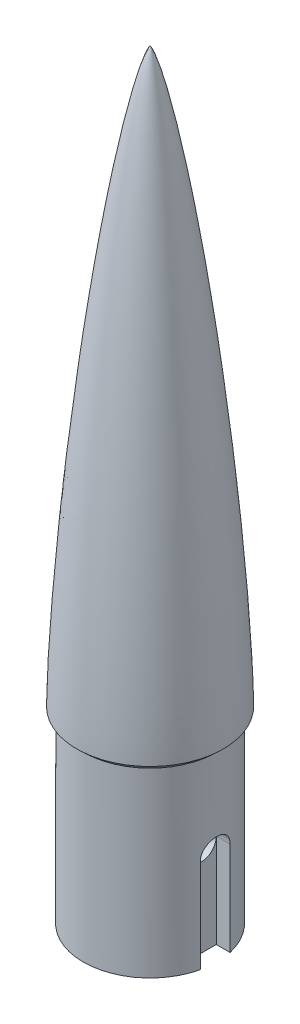
ISO-10303-21;
HEADER;
FILE_DESCRIPTION(('STEP AP214'),'2;1');
FILE_NAME('part.step','',(''),(''),'','','');
FILE_SCHEMA(('AUTOMOTIVE_DESIGN { 1 0 10303 214 1 1 1 1 }'));
ENDSEC;
DATA;
#1=APPLICATION_CONTEXT('core data for automotive mechanical design processes');
#2=APPLICATION_PROTOCOL_DEFINITION('international standard','automotive_design',2000,#1);
#3=PRODUCT_CONTEXT('',#1,'mechanical');
#4=PRODUCT('Part','Part','',(#3));
#5=PRODUCT_RELATED_PRODUCT_CATEGORY('part','',(#4));
#6=PRODUCT_DEFINITION_FORMATION('','',#4);
#7=PRODUCT_DEFINITION_CONTEXT('part definition',#1,'design');
#8=PRODUCT_DEFINITION('design','',#6,#7);
#9=PRODUCT_DEFINITION_SHAPE('','',#8);
#10=(LENGTH_UNIT() NAMED_UNIT(*) SI_UNIT(.MILLI.,.METRE.));
#11=(NAMED_UNIT(*) PLANE_ANGLE_UNIT() SI_UNIT($,.RADIAN.));
#12=(NAMED_UNIT(*) SI_UNIT($,.STERADIAN.) SOLID_ANGLE_UNIT());
#13=UNCERTAINTY_MEASURE_WITH_UNIT(LENGTH_MEASURE(1.E-05),#10,'distance_accuracy_value','');
#14=(GEOMETRIC_REPRESENTATION_CONTEXT(3) GLOBAL_UNCERTAINTY_ASSIGNED_CONTEXT((#13)) GLOBAL_UNIT_ASSIGNED_CONTEXT((#10,
#11,#12)) REPRESENTATION_CONTEXT('',''));
#15=CARTESIAN_POINT('',(0.,0.,0.));
#16=DIRECTION('',(0.,0.,1.));
#17=DIRECTION('',(1.,0.,0.));
#18=AXIS2_PLACEMENT_3D('',#15,#16,#17);
#19=CARTESIAN_POINT('',(0.,-25.,0.));
#20=DIRECTION('',(0.,1.,0.));
#21=DIRECTION('',(0.,0.,1.));
#22=AXIS2_PLACEMENT_3D('',#19,#20,#21);
#23=CYLINDRICAL_SURFACE('',#22,8.895);
#24=CARTESIAN_POINT('',(0.,-0.800000000000009,0.));
#25=DIRECTION('',(0.,-1.,0.));
#26=DIRECTION('',(0.,0.,-1.));
#27=AXIS2_PLACEMENT_3D('',#24,#25,#26);
#28=CIRCLE('',#27,8.895);
#29=CARTESIAN_POINT('',(0.,-0.800000000000009,-8.895));
#30=VERTEX_POINT('',#29);
#31=EDGE_CURVE('E11',#30,#30,#28,.T.);
#32=ORIENTED_EDGE('',*,*,#31,.T.);
#33=EDGE_LOOP('',(#32));
#34=FACE_BOUND('',#33,.T.);
#35=DIRECTION('',(0.,-1.,0.));
#36=VECTOR('',#35,1.);
#37=CARTESIAN_POINT('',(-8.67082930632215,-12.5,-1.98437499999999));
#38=LINE('',#37,#36);
#39=CARTESIAN_POINT('',(-8.67082930632215,-12.5,-1.984375));
#40=VERTEX_POINT('',#39);
#41=CARTESIAN_POINT('',(-8.67082930632215,-25.,-1.98437499999999));
#42=VERTEX_POINT('',#41);
#43=EDGE_CURVE('E187',#40,#42,#38,.T.);
#44=ORIENTED_EDGE('',*,*,#43,.F.);
#45=CARTESIAN_POINT('',(-8.895,-10.515625,0.));
#46=CARTESIAN_POINT('',(-8.89499798053136,-10.5156286782961,-0.110003108531044));
#47=CARTESIAN_POINT('',(-8.89293872905295,-10.5248028437771,-0.220050190385659));
#48=CARTESIAN_POINT('',(-8.88492294410009,-10.5612168017032,-0.437014773196951));
#49=CARTESIAN_POINT('',(-8.87896370197709,-10.5884691501126,-0.543930045069365));
#50=CARTESIAN_POINT('',(-8.86381097564101,-10.66014046251,-0.751464389222808));
#51=CARTESIAN_POINT('',(-8.85462093856362,-10.7045411348459,-0.852090038043748));
#52=CARTESIAN_POINT('',(-8.83399673910637,-10.809189812261,-1.04446068714721));
#53=CARTESIAN_POINT('',(-8.82256261666939,-10.8694375352822,-1.13620584545178));
#54=CARTESIAN_POINT('',(-8.79848845487047,-11.0051316026497,-1.30974205494041));
#55=CARTESIAN_POINT('',(-8.78583296110134,-11.0807914141361,-1.39136405863448));
#56=CARTESIAN_POINT('',(-8.76085045969245,-11.2447038420026,-1.54087074401027));
#57=CARTESIAN_POINT('',(-8.74852348238285,-11.332957616368,-1.60875416107165));
#58=CARTESIAN_POINT('',(-8.72544092397066,-11.520810939859,-1.72960902031442));
#59=CARTESIAN_POINT('',(-8.71470512331446,-11.6205296910602,-1.78239929438126));
#60=CARTESIAN_POINT('',(-8.69624278881732,-11.8277023668504,-1.87040686218199));
#61=CARTESIAN_POINT('',(-8.68851587956583,-11.9351553244818,-1.90562634832583));
#62=CARTESIAN_POINT('',(-8.67710379688232,-12.1529089981679,-1.95693151039241));
#63=CARTESIAN_POINT('',(-8.67335534128796,-12.2631356576469,-1.9733171227466));
#64=CARTESIAN_POINT('',(-8.67013460913494,-12.4848322544565,-1.98742225140913));
#65=CARTESIAN_POINT('',(-8.67066178498573,-12.5963020307519,-1.98514415802333));
#66=CARTESIAN_POINT('',(-8.6758755128654,-12.8150819521088,-1.96222763913715));
#67=CARTESIAN_POINT('',(-8.68048286491296,-12.9224308899092,-1.94193880078754));
#68=CARTESIAN_POINT('',(-8.69321246305035,-13.1321618701326,-1.88413107223078));
#69=CARTESIAN_POINT('',(-8.70133491344556,-13.2345436234669,-1.84661118050843));
#70=CARTESIAN_POINT('',(-8.72025684575896,-13.4324107413625,-1.75508849250558));
#71=CARTESIAN_POINT('',(-8.73107785800529,-13.5278322502844,-1.70095228060515));
#72=CARTESIAN_POINT('',(-8.75416459631689,-13.7083654708171,-1.57782741855743));
#73=CARTESIAN_POINT('',(-8.76643052669428,-13.7934757209513,-1.50883666682662));
#74=CARTESIAN_POINT('',(-8.79136402902234,-13.9529819654673,-1.35611581093398));
#75=CARTESIAN_POINT('',(-8.8040344247618,-14.0270934621295,-1.27208872607875));
#76=CARTESIAN_POINT('',(-8.82809796612522,-14.1602203300518,-1.09265382918496));
#77=CARTESIAN_POINT('',(-8.83949108676558,-14.2192354060537,-0.99724579460952));
#78=CARTESIAN_POINT('',(-8.85975573704167,-14.3205689320845,-0.797402322384055));
#79=CARTESIAN_POINT('',(-8.86862144653922,-14.3628489299928,-0.692946759215006));
#80=CARTESIAN_POINT('',(-8.88278925247284,-14.4291766978656,-0.478171595830713));
#81=CARTESIAN_POINT('',(-8.88809188846723,-14.4532272283998,-0.367852886206666));
#82=CARTESIAN_POINT('',(-8.89445888054048,-14.4819968395156,-0.146922244637292));
#83=CARTESIAN_POINT('',(-8.89560839126927,-14.487104381303,-0.0363632839080309));
#84=CARTESIAN_POINT('',(-8.89377875578923,-14.4788975892449,0.184028216567811));
#85=CARTESIAN_POINT('',(-8.8907999015053,-14.4655845579548,0.293860807125686));
#86=CARTESIAN_POINT('',(-8.88110209755264,-14.4212364374193,0.508386435136476));
#87=CARTESIAN_POINT('',(-8.87442639805636,-14.3904061793644,0.613123945630332));
#88=CARTESIAN_POINT('',(-8.85808259752387,-14.3121269856043,0.815940337496674));
#89=CARTESIAN_POINT('',(-8.84841423460527,-14.2646765954544,0.914018635217614));
#90=CARTESIAN_POINT('',(-8.82694819211914,-14.1537022358176,1.10233086452755));
#91=CARTESIAN_POINT('',(-8.81512120261388,-14.0899514567944,1.1924277186746));
#92=CARTESIAN_POINT('',(-8.79070766484064,-13.9484834474263,1.36078396392382));
#93=CARTESIAN_POINT('',(-8.77812101382286,-13.8707643249358,1.43904174866253));
#94=CARTESIAN_POINT('',(-8.75331093693519,-13.7017800928848,1.58304298834678));
#95=CARTESIAN_POINT('',(-8.74109914583823,-13.6102832900571,1.64851693602485));
#96=CARTESIAN_POINT('',(-8.71869698047453,-13.4173649355546,1.76317168339184));
#97=CARTESIAN_POINT('',(-8.70850651768816,-13.315943818784,1.81235319663538));
#98=CARTESIAN_POINT('',(-8.69140054463049,-13.1066041991113,1.89268852324433));
#99=CARTESIAN_POINT('',(-8.68446640876592,-12.9987267288714,1.92394509722755));
#100=CARTESIAN_POINT('',(-8.67462629679212,-12.7790753551192,1.96784118701104));
#101=CARTESIAN_POINT('',(-8.67171964652347,-12.6673021069317,1.98048381861487));
#102=CARTESIAN_POINT('',(-8.67030729710035,-12.4457524437848,1.9866564116767));
#103=CARTESIAN_POINT('',(-8.67170310734381,-12.3359883589578,1.98061409297813));
#104=CARTESIAN_POINT('',(-8.67851500496339,-12.1190849742809,1.95054750257742));
#105=CARTESIAN_POINT('',(-8.68393104095299,-12.0119456408994,1.92652346071756));
#106=CARTESIAN_POINT('',(-8.6981241844418,-11.8036893505729,1.86138575645093));
#107=CARTESIAN_POINT('',(-8.70688857054173,-11.7025512531436,1.82033672721598));
#108=CARTESIAN_POINT('',(-8.72679539432478,-11.5085347915276,1.72236893705458));
#109=CARTESIAN_POINT('',(-8.73793809113817,-11.4156573289467,1.66544844663638));
#110=CARTESIAN_POINT('',(-8.76163848646004,-11.238695474782,1.53594515186167));
#111=CARTESIAN_POINT('',(-8.77422098481682,-11.154836679788,1.46305855847869));
#112=CARTESIAN_POINT('',(-8.79921922589108,-11.0004001651611,1.30430465490752));
#113=CARTESIAN_POINT('',(-8.81163492929224,-10.9298255275292,1.21843434073407));
#114=CARTESIAN_POINT('',(-8.83510136371243,-10.8030382120514,1.03474108869537));
#115=CARTESIAN_POINT('',(-8.84613120897754,-10.7470341562857,0.936771332481138));
#116=CARTESIAN_POINT('',(-8.86537241774909,-10.6523773860926,0.732581640881906));
#117=CARTESIAN_POINT('',(-8.87358609932992,-10.6137103928671,0.626368579579056));
#118=CARTESIAN_POINT('',(-8.88483654653533,-10.5615673365609,0.43340420838887));
#119=CARTESIAN_POINT('',(-8.88862390497389,-10.5443723842688,0.347682052709739));
#120=CARTESIAN_POINT('',(-8.8937063738634,-10.5214000285145,0.174649120553264));
#121=CARTESIAN_POINT('',(-8.89500160338379,-10.5156220795683,0.0873384201749424));
#122=CARTESIAN_POINT('',(-8.895,-10.515625,0.));
#123=B_SPLINE_CURVE_WITH_KNOTS('',3,(#45,#46,#47,#48,#49,#50,#51,#52,#53,#54,#55,#56,#57,#58,
#59,#60,#61,#62,#63,#64,#65,#66,#67,#68,#69,#70,#71,#72,#73,#74,#75,#76,#77,#78,#79,#80,#81,#82,
#83,#84,#85,#86,#87,#88,#89,#90,#91,#92,#93,#94,#95,#96,#97,#98,#99,#100,#101,#102,#103,#104,
#105,#106,#107,#108,#109,#110,#111,#112,#113,#114,#115,#116,#117,#118,#119,#120,#121,#122),
.UNSPECIFIED.,.T.,.F.,(4,2,2,2,2,2,2,2,2,2,2,2,2,2,2,2,2,2,2,2,2,2,2,2,2,2,2,2,2,2,2,2,2,2,2,2,
2,2,4),(0.,0.32968958471569,0.659608391077071,0.989176249620352,1.31873824265806,
1.65322013476703,1.98773280154188,2.32610663322488,2.6644382334597,2.99730368340978,
3.33012650314447,3.65662716066737,3.98314679768962,4.31235992028412,4.64161964977686,
4.97829541698964,5.31497776845579,5.65242928429447,5.98982968812842,6.32027155964406,
6.65069006614927,6.9773221968005,7.30398291850589,7.63546294699817,7.96698791151875,
8.30488633992517,8.64276996754305,8.97869668766252,9.31456717032856,9.64280656540119,
9.97104176499135,10.2980421054524,10.6250780926347,10.9589814011184,11.2929620818613,
11.631489944489,11.9697384812382,12.2315123866697,12.493273784704),.UNSPECIFIED.);
#124=CARTESIAN_POINT('',(-8.67082930632215,-12.5,1.984375));
#125=VERTEX_POINT('',#124);
#126=EDGE_CURVE('E149',#125,#40,#123,.T.);
#127=ORIENTED_EDGE('',*,*,#126,.F.);
#128=DIRECTION('',(0.,-1.,0.));
#129=VECTOR('',#128,1.);
#130=CARTESIAN_POINT('',(-8.67082930632215,-12.5,1.984375));
#131=LINE('',#130,#129);
#132=CARTESIAN_POINT('',(-8.67082930632215,-25.,1.984375));
#133=VERTEX_POINT('',#132);
#134=EDGE_CURVE('E190',#125,#133,#131,.T.);
#135=ORIENTED_EDGE('',*,*,#134,.T.);
#136=CARTESIAN_POINT('',(0.,-25.,0.));
#137=DIRECTION('',(0.,1.,0.));
#138=DIRECTION('',(0.,0.,1.));
#139=AXIS2_PLACEMENT_3D('',#136,#137,#138);
#140=CIRCLE('',#139,8.895);
#141=CARTESIAN_POINT('',(8.67082930632215,-25.,1.984375));
#142=VERTEX_POINT('',#141);
#143=EDGE_CURVE('E196',#133,#142,#140,.T.);
#144=ORIENTED_EDGE('',*,*,#143,.T.);
#145=DIRECTION('',(0.,-1.,0.));
#146=VECTOR('',#145,1.);
#147=CARTESIAN_POINT('',(8.67082930632215,-12.5,1.984375));
#148=LINE('',#147,#146);
#149=CARTESIAN_POINT('',(8.67082930632215,-12.5,1.984375));
#150=VERTEX_POINT('',#149);
#151=EDGE_CURVE('E57',#150,#142,#148,.T.);
#152=ORIENTED_EDGE('',*,*,#151,.F.);
#153=CARTESIAN_POINT('',(8.67082930632215,-12.5,-1.984375));
#154=CARTESIAN_POINT('',(8.67083152693427,-12.3900352924012,-1.98437129476868));
#155=CARTESIAN_POINT('',(8.67294398159313,-12.2800265459929,-1.97520331559507));
#156=CARTESIAN_POINT('',(8.68114924080244,-12.0631415333078,-1.9388161542682));
#157=CARTESIAN_POINT('',(8.687244848201,-11.956267528248,-1.91158426077147));
#158=CARTESIAN_POINT('',(8.70269247518692,-11.748820633369,-1.83997273746253));
#159=CARTESIAN_POINT('',(8.71204083806803,-11.6482408168817,-1.79561235715901));
#160=CARTESIAN_POINT('',(8.73293623267991,-11.4559475998378,-1.69105869172377));
#161=CARTESIAN_POINT('',(8.74448323779282,-11.3642340919615,-1.63086559826731));
#162=CARTESIAN_POINT('',(8.76870152698746,-11.190664815864,-1.49522783567887));
#163=CARTESIAN_POINT('',(8.78138768085908,-11.1089875068265,-1.41955741552215));
#164=CARTESIAN_POINT('',(8.80632483899608,-10.959373320034,-1.25560020996667));
#165=CARTESIAN_POINT('',(8.81857580851969,-10.8914375372732,-1.16731242010812));
#166=CARTESIAN_POINT('',(8.8414245341093,-10.7705257147047,-0.979426653986215));
#167=CARTESIAN_POINT('',(8.85200269761223,-10.7177218091067,-0.879715314874414));
#168=CARTESIAN_POINT('',(8.87014575131516,-10.6296870280497,-0.672558617309702));
#169=CARTESIAN_POINT('',(8.8777109934971,-10.5944540997552,-0.56511416400382));
#170=CARTESIAN_POINT('',(8.88887072235122,-10.5431240620808,-0.347397468059264));
#171=CARTESIAN_POINT('',(8.89252784470798,-10.5267247747917,-0.237199733411299));
#172=CARTESIAN_POINT('',(8.89567645545256,-10.5125822573189,-0.0155605825450066));
#173=CARTESIAN_POINT('',(8.89516843879117,-10.5148368104668,0.0958806843305372));
#174=CARTESIAN_POINT('',(8.89009171695082,-10.5377139363359,0.31475870560092));
#175=CARTESIAN_POINT('',(8.88559503342556,-10.5580107416537,0.422231426260748));
#176=CARTESIAN_POINT('',(8.8731285194068,-10.6158765069307,0.63220575827785));
#177=CARTESIAN_POINT('',(8.86515852778899,-10.6534462681744,0.734707138772998));
#178=CARTESIAN_POINT('',(8.84652583210922,-10.7450763392216,0.932727372605715));
#179=CARTESIAN_POINT('',(8.83584323372576,-10.7992591265551,1.02818760316908));
#180=CARTESIAN_POINT('',(8.81295504188348,-10.9224856773742,1.2087789663073));
#181=CARTESIAN_POINT('',(8.80074923327929,-10.9915315411911,1.29390863638836));
#182=CARTESIAN_POINT('',(8.77584357058241,-11.1442943709138,1.45336071135604));
#183=CARTESIAN_POINT('',(8.76313874101006,-11.2282964215203,1.5274094616731));
#184=CARTESIAN_POINT('',(8.73891357366072,-11.4076579397835,1.66042127107666));
#185=CARTESIAN_POINT('',(8.72739327066983,-11.5030177408069,1.71938388720298));
#186=CARTESIAN_POINT('',(8.70682769295961,-11.7028425850512,1.82067818880462));
#187=CARTESIAN_POINT('',(8.69779041740815,-11.8073356589106,1.86295631105176));
#188=CARTESIAN_POINT('',(8.68332365321309,-12.022193123648,1.92926911648296));
#189=CARTESIAN_POINT('',(8.67789356668125,-12.1325565382453,1.95330682309304));
#190=CARTESIAN_POINT('',(8.67137842965835,-12.3535164219845,1.98202813124953));
#191=CARTESIAN_POINT('',(8.6702037566994,-12.4640584104577,1.98711100551234));
#192=CARTESIAN_POINT('',(8.67209039478514,-12.6844102825169,1.97886095731595));
#193=CARTESIAN_POINT('',(8.67515140212929,-12.7942202180243,1.96552935518464));
#194=CARTESIAN_POINT('',(8.68507970183092,-13.008588609668,1.92117571919051));
#195=CARTESIAN_POINT('',(8.69189929584423,-13.1131953191398,1.8903752346446));
#196=CARTESIAN_POINT('',(8.70853304572482,-13.3157631209793,1.81219878075513));
#197=CARTESIAN_POINT('',(8.71834749764175,-13.4137235551742,1.76482117265091));
#198=CARTESIAN_POINT('',(8.74006093984554,-13.6019411777236,1.65396154223488));
#199=CARTESIAN_POINT('',(8.75199070504297,-13.6920504352035,1.59023451518154));
#200=CARTESIAN_POINT('',(8.7765101984565,-13.8604425592094,1.4488041612309));
#201=CARTESIAN_POINT('',(8.78910001194908,-13.9387238925018,1.37109902523044));
#202=CARTESIAN_POINT('',(8.81381758079177,-14.0827966953209,1.20210799703321));
#203=CARTESIAN_POINT('',(8.82593157346983,-14.14831541272,1.11058721230565));
#204=CARTESIAN_POINT('',(8.84807556919855,-14.2630486894093,0.91760694147292));
#205=CARTESIAN_POINT('',(8.85810567158719,-14.3122640259399,0.816147929457443));
#206=CARTESIAN_POINT('',(8.87489393112164,-14.3926180815481,0.606815775294063));
#207=CARTESIAN_POINT('',(8.88167322724541,-14.423873857297,0.498989339167028));
#208=CARTESIAN_POINT('',(8.89128759699143,-14.4677855598397,0.279447263775833));
#209=CARTESIAN_POINT('',(8.89412326837703,-14.4804443055345,0.167732216568148));
#210=CARTESIAN_POINT('',(8.89551225388667,-14.4866716096712,-0.0538303410463871));
#211=CARTESIAN_POINT('',(8.89415677257247,-14.4806467378316,-0.1636660480899));
#212=CARTESIAN_POINT('',(8.88751206547856,-14.4505901194767,-0.380717396055891));
#213=CARTESIAN_POINT('',(8.88222291602629,-14.4265587223531,-0.487933087774485));
#214=CARTESIAN_POINT('',(8.86831291596493,-14.3613693329617,-0.696371660604404));
#215=CARTESIAN_POINT('',(8.85970370424092,-14.3202711322204,-0.797614067913526));
#216=CARTESIAN_POINT('',(8.84007111469181,-14.2221722616271,-0.991819184416284));
#217=CARTESIAN_POINT('',(8.82904749249992,-14.1651699819348,-1.08478105418124));
#218=CARTESIAN_POINT('',(8.80551621508588,-14.0355666300762,-1.26176241652204));
#219=CARTESIAN_POINT('',(8.79298364506869,-13.9626809241806,-1.34557017665365));
#220=CARTESIAN_POINT('',(8.76797805507896,-13.8039510336438,-1.49990415519922));
#221=CARTESIAN_POINT('',(8.7555050502752,-13.7181037126502,-1.57042714975871));
#222=CARTESIAN_POINT('',(8.73183513193552,-13.5344380779377,-1.69714603015807));
#223=CARTESIAN_POINT('',(8.72065858524308,-13.4364686619124,-1.75312694377475));
#224=CARTESIAN_POINT('',(8.7011051990314,-13.2322823615859,-1.84774053682795));
#225=CARTESIAN_POINT('',(8.69272603418347,-13.126072418212,-1.88638763425605));
#226=CARTESIAN_POINT('',(8.68123438698859,-12.9331580464439,-1.93848519859973));
#227=CARTESIAN_POINT('',(8.67735881646133,-12.847485490319,-1.95566030472962));
#228=CARTESIAN_POINT('',(8.67215546197685,-12.6745511498479,-1.97860637521381));
#229=CARTESIAN_POINT('',(8.67082754361105,-12.5872894495867,-1.98437794119458));
#230=CARTESIAN_POINT('',(8.67082930632215,-12.5,-1.984375));
#231=B_SPLINE_CURVE_WITH_KNOTS('',3,(#153,#154,#155,#156,#157,#158,#159,#160,#161,#162,#163,
#164,#165,#166,#167,#168,#169,#170,#171,#172,#173,#174,#175,#176,#177,#178,#179,#180,#181,#182,
#183,#184,#185,#186,#187,#188,#189,#190,#191,#192,#193,#194,#195,#196,#197,#198,#199,#200,#201,
#202,#203,#204,#205,#206,#207,#208,#209,#210,#211,#212,#213,#214,#215,#216,#217,#218,#219,#220,
#221,#222,#223,#224,#225,#226,#227,#228,#229,#230),.UNSPECIFIED.,.T.,.F.,(4,2,2,2,2,2,2,2,2,2,2,
2,2,2,2,2,2,2,2,2,2,2,2,2,2,2,2,2,2,2,2,2,2,2,2,2,2,2,4),(0.,0.329574133527324,
0.659380430494616,0.988817154975628,1.31824989138673,1.6528827972829,1.98754235792109,
2.32587008991828,2.66415828546683,2.99693943397993,3.32968103809655,3.65653406946799,
3.98340226493483,4.31274068542326,4.6421256759768,4.97863673959058,5.31515768273329,
5.65275035769749,5.99028706301795,6.32067223910689,6.65103372763026,6.97729620213301,
7.30359093900236,7.63509437723089,7.96664075087856,8.30464018838773,8.64262350993627,
8.97837818149084,9.31408195476448,9.64253221398148,9.97097610023751,10.2982789020109,
10.6256148460068,10.9593860612475,11.2932381697132,11.6317758832356,11.9700314818907,
12.2316596280387,12.4932739708748),.UNSPECIFIED.);
#232=CARTESIAN_POINT('',(8.67082930632215,-12.5,-1.984375));
#233=VERTEX_POINT('',#232);
#234=EDGE_CURVE('E123',#233,#150,#231,.T.);
#235=ORIENTED_EDGE('',*,*,#234,.F.);
#236=DIRECTION('',(0.,-1.,0.));
#237=VECTOR('',#236,1.);
#238=CARTESIAN_POINT('',(8.67082930632215,-12.5,-1.98437499999999));
#239=LINE('',#238,#237);
#240=CARTESIAN_POINT('',(8.67082930632215,-25.,-1.98437499999999));
#241=VERTEX_POINT('',#240);
#242=EDGE_CURVE('E161',#233,#241,#239,.T.);
#243=ORIENTED_EDGE('',*,*,#242,.T.);
#244=EDGE_CURVE('E189',#241,#42,#140,.T.);
#245=ORIENTED_EDGE('',*,*,#244,.T.);
#246=EDGE_LOOP('',(#44,#127,#135,#144,#152,#235,#243,#245));
#247=FACE_BOUND('',#246,.T.);
#248=ADVANCED_FACE('F41',(#34,#247),#23,.T.);
#249=CARTESIAN_POINT('',(0.,-25.,0.));
#250=DIRECTION('',(0.,1.,0.));
#251=DIRECTION('',(0.,0.,1.));
#252=AXIS2_PLACEMENT_3D('',#249,#250,#251);
#253=PLANE('',#252);
#254=DIRECTION('',(-1.,0.,0.));
#255=VECTOR('',#254,1.);
#256=CARTESIAN_POINT('',(6.83125,-25.,-1.984375));
#257=LINE('',#256,#255);
#258=CARTESIAN_POINT('',(6.83125,-25.,-1.984375));
#259=VERTEX_POINT('',#258);
#260=EDGE_CURVE('E154',#241,#259,#257,.T.);
#261=ORIENTED_EDGE('',*,*,#260,.T.);
#262=DIRECTION('',(0.,0.,1.));
#263=VECTOR('',#262,1.);
#264=CARTESIAN_POINT('',(6.83125,-25.,1.984375));
#265=LINE('',#264,#263);
#266=CARTESIAN_POINT('',(6.83125,-25.,1.984375));
#267=VERTEX_POINT('',#266);
#268=EDGE_CURVE('E159',#259,#267,#265,.T.);
#269=ORIENTED_EDGE('',*,*,#268,.T.);
#270=DIRECTION('',(1.,0.,0.));
#271=VECTOR('',#270,1.);
#272=CARTESIAN_POINT('',(6.83125,-25.,1.984375));
#273=LINE('',#272,#271);
#274=EDGE_CURVE('E164',#267,#142,#273,.T.);
#275=ORIENTED_EDGE('',*,*,#274,.T.);
#276=ORIENTED_EDGE('',*,*,#143,.F.);
#277=DIRECTION('',(-1.,0.,0.));
#278=VECTOR('',#277,1.);
#279=CARTESIAN_POINT('',(-6.83125,-25.,1.984375));
#280=LINE('',#279,#278);
#281=CARTESIAN_POINT('',(-6.83125,-25.,1.984375));
#282=VERTEX_POINT('',#281);
#283=EDGE_CURVE('E179',#282,#133,#280,.T.);
#284=ORIENTED_EDGE('',*,*,#283,.F.);
#285=DIRECTION('',(0.,0.,1.));
#286=VECTOR('',#285,1.);
#287=CARTESIAN_POINT('',(-6.83125,-25.,1.984375));
#288=LINE('',#287,#286);
#289=CARTESIAN_POINT('',(-6.83125,-25.,-1.984375));
#290=VERTEX_POINT('',#289);
#291=EDGE_CURVE('E183',#290,#282,#288,.T.);
#292=ORIENTED_EDGE('',*,*,#291,.F.);
#293=DIRECTION('',(1.,0.,0.));
#294=VECTOR('',#293,1.);
#295=CARTESIAN_POINT('',(-6.83125,-25.,-1.984375));
#296=LINE('',#295,#294);
#297=EDGE_CURVE('E65',#42,#290,#296,.T.);
#298=ORIENTED_EDGE('',*,*,#297,.F.);
#299=ORIENTED_EDGE('',*,*,#244,.F.);
#300=EDGE_LOOP('',(#261,#269,#275,#276,#284,#292,#298,#299));
#301=FACE_BOUND('',#300,.T.);
#302=ADVANCED_FACE('F209',(#301),#253,.F.);
#303=CARTESIAN_POINT('',(-6.83125,-12.5,-1.984375));
#304=DIRECTION('',(0.,0.,-1.));
#305=DIRECTION('',(-1.,0.,0.));
#306=AXIS2_PLACEMENT_3D('',#303,#304,#305);
#307=PLANE('',#306);
#308=ORIENTED_EDGE('',*,*,#297,.T.);
#309=DIRECTION('',(0.,-1.,0.));
#310=VECTOR('',#309,1.);
#311=CARTESIAN_POINT('',(-6.83125,-12.5,-1.984375));
#312=LINE('',#311,#310);
#313=CARTESIAN_POINT('',(-6.83125,-12.5,-1.984375));
#314=VERTEX_POINT('',#313);
#315=EDGE_CURVE('E181',#314,#290,#312,.T.);
#316=ORIENTED_EDGE('',*,*,#315,.F.);
#317=DIRECTION('',(1.,0.,0.));
#318=VECTOR('',#317,1.);
#319=CARTESIAN_POINT('',(-6.83125,-12.5,-1.984375));
#320=LINE('',#319,#318);
#321=EDGE_CURVE('E176',#40,#314,#320,.T.);
#322=ORIENTED_EDGE('',*,*,#321,.F.);
#323=ORIENTED_EDGE('',*,*,#43,.T.);
#324=EDGE_LOOP('',(#308,#316,#322,#323));
#325=FACE_BOUND('',#324,.T.);
#326=ADVANCED_FACE('F214',(#325),#307,.F.);
#327=CARTESIAN_POINT('',(-6.83125,-12.5,1.984375));
#328=DIRECTION('',(0.,0.,1.));
#329=DIRECTION('',(1.,0.,0.));
#330=AXIS2_PLACEMENT_3D('',#327,#328,#329);
#331=PLANE('',#330);
#332=ORIENTED_EDGE('',*,*,#283,.T.);
#333=ORIENTED_EDGE('',*,*,#134,.F.);
#334=DIRECTION('',(-1.,0.,0.));
#335=VECTOR('',#334,1.);
#336=CARTESIAN_POINT('',(-6.83125,-12.5,1.984375));
#337=LINE('',#336,#335);
#338=CARTESIAN_POINT('',(-6.83125,-12.5,1.984375));
#339=VERTEX_POINT('',#338);
#340=EDGE_CURVE('E178',#339,#125,#337,.T.);
#341=ORIENTED_EDGE('',*,*,#340,.F.);
#342=DIRECTION('',(0.,-1.,0.));
#343=VECTOR('',#342,1.);
#344=CARTESIAN_POINT('',(-6.83125,-12.5,1.984375));
#345=LINE('',#344,#343);
#346=EDGE_CURVE('E193',#339,#282,#345,.T.);
#347=ORIENTED_EDGE('',*,*,#346,.T.);
#348=EDGE_LOOP('',(#332,#333,#341,#347));
#349=FACE_BOUND('',#348,.T.);
#350=ADVANCED_FACE('F232',(#349),#331,.F.);
#351=CARTESIAN_POINT('',(-6.83125,-12.5,1.984375));
#352=DIRECTION('',(1.,0.,0.));
#353=DIRECTION('',(0.,0.,-1.));
#354=AXIS2_PLACEMENT_3D('',#351,#352,#353);
#355=PLANE('',#354);
#356=ORIENTED_EDGE('',*,*,#346,.F.);
#357=CARTESIAN_POINT('',(-6.83125,-12.5,0.));
#358=DIRECTION('',(1.,0.,0.));
#359=DIRECTION('',(0.,0.,-1.));
#360=AXIS2_PLACEMENT_3D('',#357,#358,#359);
#361=CIRCLE('',#360,1.984375);
#362=EDGE_CURVE('E135',#339,#314,#361,.T.);
#363=ORIENTED_EDGE('',*,*,#362,.T.);
#364=ORIENTED_EDGE('',*,*,#315,.T.);
#365=ORIENTED_EDGE('',*,*,#291,.T.);
#366=EDGE_LOOP('',(#356,#363,#364,#365));
#367=FACE_BOUND('',#366,.T.);
#368=ADVANCED_FACE('F227',(#367),#355,.F.);
#369=CARTESIAN_POINT('',(6.83125,-12.5,-1.984375));
#370=DIRECTION('',(0.,0.,1.));
#371=DIRECTION('',(1.,0.,0.));
#372=AXIS2_PLACEMENT_3D('',#369,#370,#371);
#373=PLANE('',#372);
#374=ORIENTED_EDGE('',*,*,#260,.F.);
#375=ORIENTED_EDGE('',*,*,#242,.F.);
#376=DIRECTION('',(-1.,0.,0.));
#377=VECTOR('',#376,1.);
#378=CARTESIAN_POINT('',(6.83125,-12.5,-1.984375));
#379=LINE('',#378,#377);
#380=CARTESIAN_POINT('',(6.83125,-12.5,-1.984375));
#381=VERTEX_POINT('',#380);
#382=EDGE_CURVE('E155',#233,#381,#379,.T.);
#383=ORIENTED_EDGE('',*,*,#382,.T.);
#384=DIRECTION('',(0.,-1.,0.));
#385=VECTOR('',#384,1.);
#386=CARTESIAN_POINT('',(6.83125,-12.5,-1.984375));
#387=LINE('',#386,#385);
#388=EDGE_CURVE('E168',#381,#259,#387,.T.);
#389=ORIENTED_EDGE('',*,*,#388,.T.);
#390=EDGE_LOOP('',(#374,#375,#383,#389));
#391=FACE_BOUND('',#390,.T.);
#392=ADVANCED_FACE('F240',(#391),#373,.T.);
#393=CARTESIAN_POINT('',(6.83125,-12.5,1.984375));
#394=DIRECTION('',(1.,0.,0.));
#395=DIRECTION('',(0.,0.,-1.));
#396=AXIS2_PLACEMENT_3D('',#393,#394,#395);
#397=PLANE('',#396);
#398=CARTESIAN_POINT('',(6.83125,-12.5,0.));
#399=DIRECTION('',(1.,0.,0.));
#400=DIRECTION('',(0.,0.,-1.));
#401=AXIS2_PLACEMENT_3D('',#398,#399,#400);
#402=CIRCLE('',#401,1.984375);
#403=CARTESIAN_POINT('',(6.83125,-12.5,1.984375));
#404=VERTEX_POINT('',#403);
#405=EDGE_CURVE('E121',#404,#381,#402,.T.);
#406=ORIENTED_EDGE('',*,*,#405,.F.);
#407=DIRECTION('',(0.,-1.,0.));
#408=VECTOR('',#407,1.);
#409=CARTESIAN_POINT('',(6.83125,-12.5,1.984375));
#410=LINE('',#409,#408);
#411=EDGE_CURVE('E171',#404,#267,#410,.T.);
#412=ORIENTED_EDGE('',*,*,#411,.T.);
#413=ORIENTED_EDGE('',*,*,#268,.F.);
#414=ORIENTED_EDGE('',*,*,#388,.F.);
#415=EDGE_LOOP('',(#406,#412,#413,#414));
#416=FACE_BOUND('',#415,.T.);
#417=ADVANCED_FACE('F146',(#416),#397,.T.);
#418=CARTESIAN_POINT('',(6.83125,-12.5,1.984375));
#419=DIRECTION('',(0.,0.,-1.));
#420=DIRECTION('',(-1.,0.,0.));
#421=AXIS2_PLACEMENT_3D('',#418,#419,#420);
#422=PLANE('',#421);
#423=ORIENTED_EDGE('',*,*,#274,.F.);
#424=ORIENTED_EDGE('',*,*,#411,.F.);
#425=DIRECTION('',(1.,0.,0.));
#426=VECTOR('',#425,1.);
#427=CARTESIAN_POINT('',(6.83125,-12.5,1.984375));
#428=LINE('',#427,#426);
#429=EDGE_CURVE('E158',#404,#150,#428,.T.);
#430=ORIENTED_EDGE('',*,*,#429,.T.);
#431=ORIENTED_EDGE('',*,*,#151,.T.);
#432=EDGE_LOOP('',(#423,#424,#430,#431));
#433=FACE_BOUND('',#432,.T.);
#434=ADVANCED_FACE('F144',(#433),#422,.T.);
#435=CARTESIAN_POINT('',(-8.895,-12.5,0.));
#436=DIRECTION('',(1.,0.,0.));
#437=DIRECTION('',(0.,0.,-1.));
#438=AXIS2_PLACEMENT_3D('',#435,#436,#437);
#439=CYLINDRICAL_SURFACE('',#438,1.984375);
#440=ORIENTED_EDGE('',*,*,#126,.T.);
#441=ORIENTED_EDGE('',*,*,#321,.T.);
#442=ORIENTED_EDGE('',*,*,#362,.F.);
#443=ORIENTED_EDGE('',*,*,#340,.T.);
#444=EDGE_LOOP('',(#440,#441,#442,#443));
#445=FACE_BOUND('',#444,.T.);
#446=ORIENTED_EDGE('',*,*,#234,.T.);
#447=ORIENTED_EDGE('',*,*,#429,.F.);
#448=ORIENTED_EDGE('',*,*,#405,.T.);
#449=ORIENTED_EDGE('',*,*,#382,.F.);
#450=EDGE_LOOP('',(#446,#447,#448,#449));
#451=FACE_BOUND('',#450,.T.);
#452=ADVANCED_FACE('F139',(#445,#451),#439,.F.);
#453=CARTESIAN_POINT('',(0.,0.,-9.75));
#454=DIRECTION('',(0.,-1.,0.));
#455=DIRECTION('',(0.,0.,-1.));
#456=AXIS2_PLACEMENT_3D('',#453,#454,#455);
#457=PLANE('',#456);
#458=CARTESIAN_POINT('',(0.,0.,0.));
#459=DIRECTION('',(0.,-1.,0.));
#460=DIRECTION('',(0.,0.,-1.));
#461=AXIS2_PLACEMENT_3D('',#458,#459,#460);
#462=CIRCLE('',#461,9.69500000000001);
#463=CARTESIAN_POINT('',(0.,0.,-9.69500000000001));
#464=VERTEX_POINT('',#463);
#465=EDGE_CURVE('E50',#464,#464,#462,.F.);
#466=ORIENTED_EDGE('',*,*,#465,.T.);
#467=EDGE_LOOP('',(#466));
#468=FACE_BOUND('',#467,.T.);
#469=CARTESIAN_POINT('',(0.,0.,0.));
#470=DIRECTION('',(0.,-1.,0.));
#471=DIRECTION('',(0.,0.,-1.));
#472=AXIS2_PLACEMENT_3D('',#469,#470,#471);
#473=CIRCLE('',#472,9.75);
#474=CARTESIAN_POINT('',(0.,0.,-9.75));
#475=VERTEX_POINT('',#474);
#476=EDGE_CURVE('E119',#475,#475,#473,.T.);
#477=ORIENTED_EDGE('',*,*,#476,.T.);
#478=EDGE_LOOP('',(#477));
#479=FACE_BOUND('',#478,.T.);
#480=ADVANCED_FACE('F115',(#468,#479),#457,.T.);
#481=CARTESIAN_POINT('',(0.,0.,-9.75));
#482=CARTESIAN_POINT('',(0.,0.240606642817854,-9.75));
#483=CARTESIAN_POINT('',(0.,0.721793084030571,-9.74287778315088));
#484=CARTESIAN_POINT('',(0.,1.68405962011083,-9.72578957221392));
#485=CARTESIAN_POINT('',(0.,3.24277615234125,-9.68119293308093));
#486=CARTESIAN_POINT('',(0.,5.15707961956043,-9.6104571855655));
#487=CARTESIAN_POINT('',(0.,7.42660225585994,-9.50626638377952));
#488=CARTESIAN_POINT('',(0.,9.81077127684159,-9.37894390060935));
#489=CARTESIAN_POINT('',(0.,12.7898540070367,-9.19982518055983));
#490=CARTESIAN_POINT('',(0.,16.3629553086597,-8.95657012511644));
#491=CARTESIAN_POINT('',(0.,20.5289334119657,-8.63609338923967));
#492=CARTESIAN_POINT('',(0.,25.2863323128901,-8.22447916644676));
#493=CARTESIAN_POINT('',(0.,30.0398297180731,-7.77007512513928));
#494=CARTESIAN_POINT('',(0.,35.9764990894431,-7.15004405279035));
#495=CARTESIAN_POINT('',(0.,41.9055787399103,-6.46033577609523));
#496=CARTESIAN_POINT('',(0.,47.8257724527308,-5.69775640991865));
#497=CARTESIAN_POINT('',(0.,53.7344535024312,-4.85112707677434));
#498=CARTESIAN_POINT('',(0.,58.4526801004839,-4.11553616348241));
#499=CARTESIAN_POINT('',(0.,63.1595431324117,-3.30962167386693));
#500=CARTESIAN_POINT('',(0.,67.2930694953027,-2.51634451884219));
#501=CARTESIAN_POINT('',(0.,70.6448433375451,-1.78476558305083));
#502=CARTESIAN_POINT('',(0.,73.0341714391362,-1.17542132946876));
#503=CARTESIAN_POINT('',(0.,74.3739748622212,-0.780720304768572));
#504=CARTESIAN_POINT('',(0.,75.1693566718253,-0.50875994569184));
#505=CARTESIAN_POINT('',(0.,75.6031748204635,-0.337513197536386));
#506=CARTESIAN_POINT('',(0.,75.8412729785629,-0.230182006580647));
#507=CARTESIAN_POINT('',(0.,75.9771850439891,-0.160958307475345));
#508=CARTESIAN_POINT('',(0.,76.057822590319,-0.114693991544257));
#509=CARTESIAN_POINT('',(0.,76.114493710325,-0.0790166084057324));
#510=CARTESIAN_POINT('',(0.,76.1551150524529,-0.0485691660613234));
#511=CARTESIAN_POINT('',(0.,76.182931831596,-0.0261852719367971));
#512=CARTESIAN_POINT('',(0.,76.1963031354272,-0.00748236950014892));
#513=CARTESIAN_POINT('',(0.,76.2,0.));
#514=B_SPLINE_CURVE_WITH_KNOTS('',4,(#481,#482,#483,#484,#485,#486,#487,#488,#489,#490,#491,
#492,#493,#494,#495,#496,#497,#498,#499,#500,#501,#502,#503,#504,#505,#506,#507,#508,#509,#510,
#511,#512,#513),.UNSPECIFIED.,.F.,.F.,(5,1,1,1,1,1,1,1,1,1,1,1,1,1,1,1,1,1,1,1,1,1,1,1,1,1,1,1,
1,5),(0.,0.0124931542192845,0.0249863084385691,0.0499726168771383,0.0809651622670462,
0.111957707656954,0.142950277369325,0.173942847081697,0.235927911226042,0.297913047780569,
0.359898210397689,0.421883305647785,0.483868429543473,0.6078386424602,0.669823810453781,
0.731808829035661,0.79379408785304,0.855779034350758,0.917764029360739,0.950336224415065,
0.971895495571224,0.983788614467282,0.990267853358744,0.99396977625452,0.99610248030402,
0.997347007732671,0.998180881124814,0.998801282489045,0.999567661065961,1.),.UNSPECIFIED.);
#515=CARTESIAN_POINT('',(0.,0.,0.));
#516=DIRECTION('',(0.,-1.,0.));
#517=AXIS1_PLACEMENT('',#515,#516);
#518=SURFACE_OF_REVOLUTION('',#514,#517);
#519=CARTESIAN_POINT('',(0.,76.2,0.));
#520=VERTEX_POINT('',#519);
#521=VERTEX_LOOP('',#520);
#522=FACE_BOUND('',#521,.T.);
#523=ORIENTED_EDGE('',*,*,#476,.F.);
#524=EDGE_LOOP('',(#523));
#525=FACE_BOUND('',#524,.T.);
#526=ADVANCED_FACE('F112',(#522,#525),#518,.F.);
#527=CARTESIAN_POINT('',(0.,0.,0.));
#528=DIRECTION('',(0.,1.,0.));
#529=DIRECTION('',(0.,0.,1.));
#530=AXIS2_PLACEMENT_3D('',#527,#528,#529);
#531=CONICAL_SURFACE('',#530,9.69500000000001,0.785398163397448);
#532=ORIENTED_EDGE('',*,*,#31,.F.);
#533=EDGE_LOOP('',(#532));
#534=FACE_BOUND('',#533,.T.);
#535=ORIENTED_EDGE('',*,*,#465,.F.);
#536=EDGE_LOOP('',(#535));
#537=FACE_BOUND('',#536,.T.);
#538=ADVANCED_FACE('F44',(#534,#537),#531,.T.);
#539=CLOSED_SHELL('',(#248,#302,#326,#350,#368,#392,#417,#434,#452,#480,#526,#538));
#540=MANIFOLD_SOLID_BREP('B2',#539);
#541=ADVANCED_BREP_SHAPE_REPRESENTATION('',(#18,#540),#14);
#542=SHAPE_DEFINITION_REPRESENTATION(#9,#541);
ENDSEC;
END-ISO-10303-21;
